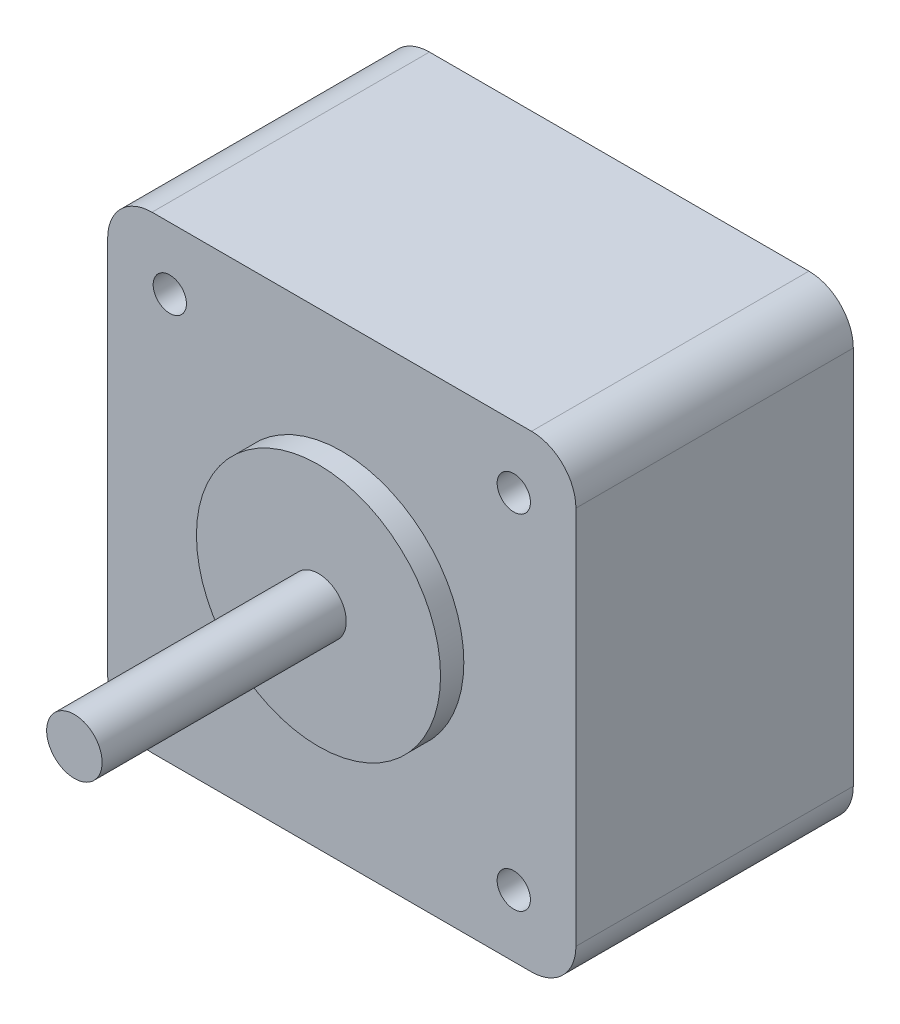
ISO-10303-21;
HEADER;
FILE_DESCRIPTION(('STEP AP214'),'2;1');
FILE_NAME('part.step','',(''),(''),'','','');
FILE_SCHEMA(('AUTOMOTIVE_DESIGN { 1 0 10303 214 1 1 1 1 }'));
ENDSEC;
DATA;
#1=APPLICATION_CONTEXT('core data for automotive mechanical design processes');
#2=APPLICATION_PROTOCOL_DEFINITION('international standard','automotive_design',2000,#1);
#3=PRODUCT_CONTEXT('',#1,'mechanical');
#4=PRODUCT('Part','Part','',(#3));
#5=PRODUCT_RELATED_PRODUCT_CATEGORY('part','',(#4));
#6=PRODUCT_DEFINITION_FORMATION('','',#4);
#7=PRODUCT_DEFINITION_CONTEXT('part definition',#1,'design');
#8=PRODUCT_DEFINITION('design','',#6,#7);
#9=PRODUCT_DEFINITION_SHAPE('','',#8);
#10=(LENGTH_UNIT() NAMED_UNIT(*) SI_UNIT(.MILLI.,.METRE.));
#11=(NAMED_UNIT(*) PLANE_ANGLE_UNIT() SI_UNIT($,.RADIAN.));
#12=(NAMED_UNIT(*) SI_UNIT($,.STERADIAN.) SOLID_ANGLE_UNIT());
#13=UNCERTAINTY_MEASURE_WITH_UNIT(LENGTH_MEASURE(1.E-05),#10,'distance_accuracy_value','');
#14=(GEOMETRIC_REPRESENTATION_CONTEXT(3) GLOBAL_UNCERTAINTY_ASSIGNED_CONTEXT((#13)) GLOBAL_UNIT_ASSIGNED_CONTEXT((#10,
#11,#12)) REPRESENTATION_CONTEXT('',''));
#15=CARTESIAN_POINT('',(0.,0.,0.));
#16=DIRECTION('',(0.,0.,1.));
#17=DIRECTION('',(1.,0.,0.));
#18=AXIS2_PLACEMENT_3D('',#15,#16,#17);
#19=CARTESIAN_POINT('',(21.1,-21.1,25.));
#20=DIRECTION('',(-1.,0.,0.));
#21=DIRECTION('',(0.,0.,1.));
#22=AXIS2_PLACEMENT_3D('',#19,#20,#21);
#23=PLANE('',#22);
#24=DIRECTION('',(0.,1.,0.));
#25=VECTOR('',#24,1.);
#26=CARTESIAN_POINT('',(21.1,-21.1,25.));
#27=LINE('',#26,#25);
#28=CARTESIAN_POINT('',(21.1,-17.1,25.));
#29=VERTEX_POINT('',#28);
#30=CARTESIAN_POINT('',(21.1,17.1,25.));
#31=VERTEX_POINT('',#30);
#32=EDGE_CURVE('E133',#29,#31,#27,.T.);
#33=ORIENTED_EDGE('',*,*,#32,.F.);
#34=DIRECTION('',(0.,0.,-1.));
#35=VECTOR('',#34,1.);
#36=CARTESIAN_POINT('',(21.1,-17.1,25.));
#37=LINE('',#36,#35);
#38=CARTESIAN_POINT('',(21.1,-17.1,0.));
#39=VERTEX_POINT('',#38);
#40=EDGE_CURVE('E117',#29,#39,#37,.T.);
#41=ORIENTED_EDGE('',*,*,#40,.T.);
#42=DIRECTION('',(0.,1.,0.));
#43=VECTOR('',#42,1.);
#44=CARTESIAN_POINT('',(21.1,-21.1,0.));
#45=LINE('',#44,#43);
#46=CARTESIAN_POINT('',(21.1,17.1,0.));
#47=VERTEX_POINT('',#46);
#48=EDGE_CURVE('E130',#39,#47,#45,.T.);
#49=ORIENTED_EDGE('',*,*,#48,.T.);
#50=DIRECTION('',(0.,0.,-1.));
#51=VECTOR('',#50,1.);
#52=CARTESIAN_POINT('',(21.1,17.1,25.));
#53=LINE('',#52,#51);
#54=EDGE_CURVE('E136',#47,#31,#53,.F.);
#55=ORIENTED_EDGE('',*,*,#54,.T.);
#56=EDGE_LOOP('',(#33,#41,#49,#55));
#57=FACE_BOUND('',#56,.T.);
#58=ADVANCED_FACE('F46',(#57),#23,.F.);
#59=CARTESIAN_POINT('',(-21.1,21.1,25.));
#60=DIRECTION('',(0.,-1.,0.));
#61=DIRECTION('',(0.,0.,-1.));
#62=AXIS2_PLACEMENT_3D('',#59,#60,#61);
#63=PLANE('',#62);
#64=DIRECTION('',(-1.,0.,0.));
#65=VECTOR('',#64,1.);
#66=CARTESIAN_POINT('',(-21.1,21.1,0.));
#67=LINE('',#66,#65);
#68=CARTESIAN_POINT('',(17.1,21.1,0.));
#69=VERTEX_POINT('',#68);
#70=CARTESIAN_POINT('',(-17.1,21.1,0.));
#71=VERTEX_POINT('',#70);
#72=EDGE_CURVE('E142',#69,#71,#67,.T.);
#73=ORIENTED_EDGE('',*,*,#72,.T.);
#74=DIRECTION('',(0.,0.,-1.));
#75=VECTOR('',#74,1.);
#76=CARTESIAN_POINT('',(-17.1,21.1,25.));
#77=LINE('',#76,#75);
#78=CARTESIAN_POINT('',(-17.1,21.1,25.));
#79=VERTEX_POINT('',#78);
#80=EDGE_CURVE('E11',#71,#79,#77,.F.);
#81=ORIENTED_EDGE('',*,*,#80,.T.);
#82=DIRECTION('',(-1.,0.,0.));
#83=VECTOR('',#82,1.);
#84=CARTESIAN_POINT('',(-21.1,21.1,25.));
#85=LINE('',#84,#83);
#86=CARTESIAN_POINT('',(17.1,21.1,25.));
#87=VERTEX_POINT('',#86);
#88=EDGE_CURVE('E204',#87,#79,#85,.T.);
#89=ORIENTED_EDGE('',*,*,#88,.F.);
#90=DIRECTION('',(0.,0.,-1.));
#91=VECTOR('',#90,1.);
#92=CARTESIAN_POINT('',(17.1,21.1,25.));
#93=LINE('',#92,#91);
#94=EDGE_CURVE('E55',#87,#69,#93,.T.);
#95=ORIENTED_EDGE('',*,*,#94,.T.);
#96=EDGE_LOOP('',(#73,#81,#89,#95));
#97=FACE_BOUND('',#96,.T.);
#98=ADVANCED_FACE('F202',(#97),#63,.F.);
#99=CARTESIAN_POINT('',(-21.1,-21.1,25.));
#100=DIRECTION('',(1.,0.,0.));
#101=DIRECTION('',(0.,0.,-1.));
#102=AXIS2_PLACEMENT_3D('',#99,#100,#101);
#103=PLANE('',#102);
#104=DIRECTION('',(0.,-1.,0.));
#105=VECTOR('',#104,1.);
#106=CARTESIAN_POINT('',(-21.1,-21.1,25.));
#107=LINE('',#106,#105);
#108=CARTESIAN_POINT('',(-21.1,17.1,25.));
#109=VERTEX_POINT('',#108);
#110=CARTESIAN_POINT('',(-21.1,-17.1,25.));
#111=VERTEX_POINT('',#110);
#112=EDGE_CURVE('E212',#109,#111,#107,.T.);
#113=ORIENTED_EDGE('',*,*,#112,.F.);
#114=DIRECTION('',(0.,0.,-1.));
#115=VECTOR('',#114,1.);
#116=CARTESIAN_POINT('',(-21.1,17.1,25.));
#117=LINE('',#116,#115);
#118=CARTESIAN_POINT('',(-21.1,17.1,0.));
#119=VERTEX_POINT('',#118);
#120=EDGE_CURVE('E192',#109,#119,#117,.T.);
#121=ORIENTED_EDGE('',*,*,#120,.T.);
#122=DIRECTION('',(0.,-1.,0.));
#123=VECTOR('',#122,1.);
#124=CARTESIAN_POINT('',(-21.1,-21.1,0.));
#125=LINE('',#124,#123);
#126=CARTESIAN_POINT('',(-21.1,-17.1,0.));
#127=VERTEX_POINT('',#126);
#128=EDGE_CURVE('E150',#119,#127,#125,.T.);
#129=ORIENTED_EDGE('',*,*,#128,.T.);
#130=DIRECTION('',(0.,0.,-1.));
#131=VECTOR('',#130,1.);
#132=CARTESIAN_POINT('',(-21.1,-17.1,25.));
#133=LINE('',#132,#131);
#134=EDGE_CURVE('E62',#127,#111,#133,.F.);
#135=ORIENTED_EDGE('',*,*,#134,.T.);
#136=EDGE_LOOP('',(#113,#121,#129,#135));
#137=FACE_BOUND('',#136,.T.);
#138=ADVANCED_FACE('F211',(#137),#103,.F.);
#139=CARTESIAN_POINT('',(-21.1,-21.1,25.));
#140=DIRECTION('',(0.,1.,0.));
#141=DIRECTION('',(0.,0.,1.));
#142=AXIS2_PLACEMENT_3D('',#139,#140,#141);
#143=PLANE('',#142);
#144=DIRECTION('',(1.,0.,0.));
#145=VECTOR('',#144,1.);
#146=CARTESIAN_POINT('',(-21.1,-21.1,0.));
#147=LINE('',#146,#145);
#148=CARTESIAN_POINT('',(-17.1,-21.1,0.));
#149=VERTEX_POINT('',#148);
#150=CARTESIAN_POINT('',(17.1,-21.1,0.));
#151=VERTEX_POINT('',#150);
#152=EDGE_CURVE('E162',#149,#151,#147,.T.);
#153=ORIENTED_EDGE('',*,*,#152,.T.);
#154=DIRECTION('',(0.,0.,-1.));
#155=VECTOR('',#154,1.);
#156=CARTESIAN_POINT('',(17.1,-21.1,25.));
#157=LINE('',#156,#155);
#158=CARTESIAN_POINT('',(17.1,-21.1,25.));
#159=VERTEX_POINT('',#158);
#160=EDGE_CURVE('E118',#151,#159,#157,.F.);
#161=ORIENTED_EDGE('',*,*,#160,.T.);
#162=DIRECTION('',(1.,0.,0.));
#163=VECTOR('',#162,1.);
#164=CARTESIAN_POINT('',(-21.1,-21.1,25.));
#165=LINE('',#164,#163);
#166=CARTESIAN_POINT('',(-17.1,-21.1,25.));
#167=VERTEX_POINT('',#166);
#168=EDGE_CURVE('E157',#167,#159,#165,.T.);
#169=ORIENTED_EDGE('',*,*,#168,.F.);
#170=DIRECTION('',(0.,0.,-1.));
#171=VECTOR('',#170,1.);
#172=CARTESIAN_POINT('',(-17.1,-21.1,25.));
#173=LINE('',#172,#171);
#174=EDGE_CURVE('E124',#167,#149,#173,.T.);
#175=ORIENTED_EDGE('',*,*,#174,.T.);
#176=EDGE_LOOP('',(#153,#161,#169,#175));
#177=FACE_BOUND('',#176,.T.);
#178=ADVANCED_FACE('F275',(#177),#143,.F.);
#179=CARTESIAN_POINT('',(0.,0.,25.));
#180=DIRECTION('',(0.,0.,-1.));
#181=DIRECTION('',(-1.,0.,0.));
#182=AXIS2_PLACEMENT_3D('',#179,#180,#181);
#183=PLANE('',#182);
#184=CARTESIAN_POINT('',(-15.5,-15.5,25.));
#185=DIRECTION('',(0.,0.,1.));
#186=DIRECTION('',(1.,0.,0.));
#187=AXIS2_PLACEMENT_3D('',#184,#185,#186);
#188=CIRCLE('',#187,1.5);
#189=CARTESIAN_POINT('',(-14.,-15.5,25.));
#190=VERTEX_POINT('',#189);
#191=EDGE_CURVE('E238',#190,#190,#188,.T.);
#192=ORIENTED_EDGE('',*,*,#191,.F.);
#193=EDGE_LOOP('',(#192));
#194=FACE_BOUND('',#193,.T.);
#195=CARTESIAN_POINT('',(15.5,-15.5,25.));
#196=DIRECTION('',(0.,0.,1.));
#197=DIRECTION('',(1.,0.,0.));
#198=AXIS2_PLACEMENT_3D('',#195,#196,#197);
#199=CIRCLE('',#198,1.5);
#200=CARTESIAN_POINT('',(17.,-15.5,25.));
#201=VERTEX_POINT('',#200);
#202=EDGE_CURVE('E246',#201,#201,#199,.T.);
#203=ORIENTED_EDGE('',*,*,#202,.F.);
#204=EDGE_LOOP('',(#203));
#205=FACE_BOUND('',#204,.T.);
#206=CARTESIAN_POINT('',(15.5,15.5,25.));
#207=DIRECTION('',(0.,0.,1.));
#208=DIRECTION('',(1.,0.,0.));
#209=AXIS2_PLACEMENT_3D('',#206,#207,#208);
#210=CIRCLE('',#209,1.5);
#211=CARTESIAN_POINT('',(17.,15.5,25.));
#212=VERTEX_POINT('',#211);
#213=EDGE_CURVE('E254',#212,#212,#210,.T.);
#214=ORIENTED_EDGE('',*,*,#213,.F.);
#215=EDGE_LOOP('',(#214));
#216=FACE_BOUND('',#215,.T.);
#217=CARTESIAN_POINT('',(-15.5,15.5,25.));
#218=DIRECTION('',(0.,0.,1.));
#219=DIRECTION('',(1.,0.,0.));
#220=AXIS2_PLACEMENT_3D('',#217,#218,#219);
#221=CIRCLE('',#220,1.5);
#222=CARTESIAN_POINT('',(-14.,15.5,25.));
#223=VERTEX_POINT('',#222);
#224=EDGE_CURVE('E231',#223,#223,#221,.T.);
#225=ORIENTED_EDGE('',*,*,#224,.F.);
#226=EDGE_LOOP('',(#225));
#227=FACE_BOUND('',#226,.T.);
#228=CARTESIAN_POINT('',(0.,0.,25.));
#229=DIRECTION('',(0.,0.,1.));
#230=DIRECTION('',(1.,0.,0.));
#231=AXIS2_PLACEMENT_3D('',#228,#229,#230);
#232=CIRCLE('',#231,11.);
#233=CARTESIAN_POINT('',(11.,0.,25.));
#234=VERTEX_POINT('',#233);
#235=EDGE_CURVE('E219',#234,#234,#232,.T.);
#236=ORIENTED_EDGE('',*,*,#235,.F.);
#237=EDGE_LOOP('',(#236));
#238=FACE_BOUND('',#237,.T.);
#239=ORIENTED_EDGE('',*,*,#168,.T.);
#240=CARTESIAN_POINT('',(17.1,-17.1,25.));
#241=DIRECTION('',(0.,0.,-1.));
#242=DIRECTION('',(-1.,0.,0.));
#243=AXIS2_PLACEMENT_3D('',#240,#241,#242);
#244=CIRCLE('',#243,4.);
#245=EDGE_CURVE('E187',#159,#29,#244,.F.);
#246=ORIENTED_EDGE('',*,*,#245,.T.);
#247=ORIENTED_EDGE('',*,*,#32,.T.);
#248=CARTESIAN_POINT('',(17.1,17.1,25.));
#249=DIRECTION('',(0.,0.,-1.));
#250=DIRECTION('',(-1.,0.,0.));
#251=AXIS2_PLACEMENT_3D('',#248,#249,#250);
#252=CIRCLE('',#251,4.);
#253=EDGE_CURVE('E182',#31,#87,#252,.F.);
#254=ORIENTED_EDGE('',*,*,#253,.T.);
#255=ORIENTED_EDGE('',*,*,#88,.T.);
#256=CARTESIAN_POINT('',(-17.1,17.1,25.));
#257=DIRECTION('',(0.,0.,-1.));
#258=DIRECTION('',(-1.,0.,0.));
#259=AXIS2_PLACEMENT_3D('',#256,#257,#258);
#260=CIRCLE('',#259,4.);
#261=EDGE_CURVE('E69',#79,#109,#260,.F.);
#262=ORIENTED_EDGE('',*,*,#261,.T.);
#263=ORIENTED_EDGE('',*,*,#112,.T.);
#264=CARTESIAN_POINT('',(-17.1,-17.1,25.));
#265=DIRECTION('',(0.,0.,-1.));
#266=DIRECTION('',(-1.,0.,0.));
#267=AXIS2_PLACEMENT_3D('',#264,#265,#266);
#268=CIRCLE('',#267,4.);
#269=EDGE_CURVE('E179',#111,#167,#268,.F.);
#270=ORIENTED_EDGE('',*,*,#269,.T.);
#271=EDGE_LOOP('',(#239,#246,#247,#254,#255,#262,#263,#270));
#272=FACE_BOUND('',#271,.T.);
#273=ADVANCED_FACE('F272',(#194,#205,#216,#227,#238,#272),#183,.F.);
#274=CARTESIAN_POINT('',(0.,0.,0.));
#275=DIRECTION('',(0.,0.,-1.));
#276=DIRECTION('',(-1.,0.,0.));
#277=AXIS2_PLACEMENT_3D('',#274,#275,#276);
#278=PLANE('',#277);
#279=ORIENTED_EDGE('',*,*,#48,.F.);
#280=CARTESIAN_POINT('',(17.1,-17.1,0.));
#281=DIRECTION('',(0.,0.,-1.));
#282=DIRECTION('',(-1.,0.,0.));
#283=AXIS2_PLACEMENT_3D('',#280,#281,#282);
#284=CIRCLE('',#283,4.);
#285=EDGE_CURVE('E113',#39,#151,#284,.T.);
#286=ORIENTED_EDGE('',*,*,#285,.T.);
#287=ORIENTED_EDGE('',*,*,#152,.F.);
#288=CARTESIAN_POINT('',(-17.1,-17.1,0.));
#289=DIRECTION('',(0.,0.,-1.));
#290=DIRECTION('',(-1.,0.,0.));
#291=AXIS2_PLACEMENT_3D('',#288,#289,#290);
#292=CIRCLE('',#291,4.);
#293=EDGE_CURVE('E135',#149,#127,#292,.T.);
#294=ORIENTED_EDGE('',*,*,#293,.T.);
#295=ORIENTED_EDGE('',*,*,#128,.F.);
#296=CARTESIAN_POINT('',(-17.1,17.1,0.));
#297=DIRECTION('',(0.,0.,-1.));
#298=DIRECTION('',(-1.,0.,0.));
#299=AXIS2_PLACEMENT_3D('',#296,#297,#298);
#300=CIRCLE('',#299,4.);
#301=EDGE_CURVE('E125',#119,#71,#300,.T.);
#302=ORIENTED_EDGE('',*,*,#301,.T.);
#303=ORIENTED_EDGE('',*,*,#72,.F.);
#304=CARTESIAN_POINT('',(17.1,17.1,0.));
#305=DIRECTION('',(0.,0.,-1.));
#306=DIRECTION('',(-1.,0.,0.));
#307=AXIS2_PLACEMENT_3D('',#304,#305,#306);
#308=CIRCLE('',#307,4.);
#309=EDGE_CURVE('E140',#69,#47,#308,.T.);
#310=ORIENTED_EDGE('',*,*,#309,.T.);
#311=EDGE_LOOP('',(#279,#286,#287,#294,#295,#302,#303,#310));
#312=FACE_BOUND('',#311,.T.);
#313=ADVANCED_FACE('F138',(#312),#278,.T.);
#314=CARTESIAN_POINT('',(0.,0.,27.1));
#315=DIRECTION('',(0.,0.,-1.));
#316=DIRECTION('',(-1.,0.,0.));
#317=AXIS2_PLACEMENT_3D('',#314,#315,#316);
#318=CYLINDRICAL_SURFACE('',#317,11.);
#319=CARTESIAN_POINT('',(0.,0.,27.1));
#320=DIRECTION('',(0.,0.,1.));
#321=DIRECTION('',(1.,0.,0.));
#322=AXIS2_PLACEMENT_3D('',#319,#320,#321);
#323=CIRCLE('',#322,11.);
#324=CARTESIAN_POINT('',(11.,0.,27.1));
#325=VERTEX_POINT('',#324);
#326=EDGE_CURVE('E143',#325,#325,#323,.T.);
#327=ORIENTED_EDGE('',*,*,#326,.F.);
#328=EDGE_LOOP('',(#327));
#329=FACE_BOUND('',#328,.T.);
#330=ORIENTED_EDGE('',*,*,#235,.T.);
#331=EDGE_LOOP('',(#330));
#332=FACE_BOUND('',#331,.T.);
#333=ADVANCED_FACE('F445',(#329,#332),#318,.T.);
#334=CARTESIAN_POINT('',(0.,0.,27.1));
#335=DIRECTION('',(0.,0.,1.));
#336=DIRECTION('',(1.,0.,0.));
#337=AXIS2_PLACEMENT_3D('',#334,#335,#336);
#338=PLANE('',#337);
#339=CARTESIAN_POINT('',(0.,0.,27.1));
#340=DIRECTION('',(0.,0.,1.));
#341=DIRECTION('',(1.,0.,0.));
#342=AXIS2_PLACEMENT_3D('',#339,#340,#341);
#343=CIRCLE('',#342,2.5);
#344=CARTESIAN_POINT('',(2.5,0.,27.1));
#345=VERTEX_POINT('',#344);
#346=EDGE_CURVE('E166',#345,#345,#343,.T.);
#347=ORIENTED_EDGE('',*,*,#346,.F.);
#348=EDGE_LOOP('',(#347));
#349=FACE_BOUND('',#348,.T.);
#350=ORIENTED_EDGE('',*,*,#326,.T.);
#351=EDGE_LOOP('',(#350));
#352=FACE_BOUND('',#351,.T.);
#353=ADVANCED_FACE('F497',(#349,#352),#338,.T.);
#354=CARTESIAN_POINT('',(0.,0.,49.1));
#355=DIRECTION('',(0.,0.,-1.));
#356=DIRECTION('',(-1.,0.,0.));
#357=AXIS2_PLACEMENT_3D('',#354,#355,#356);
#358=CYLINDRICAL_SURFACE('',#357,2.5);
#359=CARTESIAN_POINT('',(0.,0.,49.1));
#360=DIRECTION('',(0.,0.,1.));
#361=DIRECTION('',(1.,0.,0.));
#362=AXIS2_PLACEMENT_3D('',#359,#360,#361);
#363=CIRCLE('',#362,2.5);
#364=CARTESIAN_POINT('',(2.5,0.,49.1));
#365=VERTEX_POINT('',#364);
#366=EDGE_CURVE('E154',#365,#365,#363,.T.);
#367=ORIENTED_EDGE('',*,*,#366,.F.);
#368=EDGE_LOOP('',(#367));
#369=FACE_BOUND('',#368,.T.);
#370=ORIENTED_EDGE('',*,*,#346,.T.);
#371=EDGE_LOOP('',(#370));
#372=FACE_BOUND('',#371,.T.);
#373=ADVANCED_FACE('F328',(#369,#372),#358,.T.);
#374=CARTESIAN_POINT('',(0.,0.,49.1));
#375=DIRECTION('',(0.,0.,1.));
#376=DIRECTION('',(1.,0.,0.));
#377=AXIS2_PLACEMENT_3D('',#374,#375,#376);
#378=PLANE('',#377);
#379=ORIENTED_EDGE('',*,*,#366,.T.);
#380=EDGE_LOOP('',(#379));
#381=FACE_BOUND('',#380,.T.);
#382=ADVANCED_FACE('F321',(#381),#378,.T.);
#383=CARTESIAN_POINT('',(-15.5,15.5,21.));
#384=DIRECTION('',(0.,0.,1.));
#385=DIRECTION('',(1.,0.,0.));
#386=AXIS2_PLACEMENT_3D('',#383,#384,#385);
#387=CYLINDRICAL_SURFACE('',#386,1.5);
#388=CARTESIAN_POINT('',(-15.5,15.5,21.));
#389=DIRECTION('',(0.,0.,1.));
#390=DIRECTION('',(1.,0.,0.));
#391=AXIS2_PLACEMENT_3D('',#388,#389,#390);
#392=CIRCLE('',#391,1.5);
#393=CARTESIAN_POINT('',(-14.,15.5,21.));
#394=VERTEX_POINT('',#393);
#395=EDGE_CURVE('E230',#394,#394,#392,.T.);
#396=ORIENTED_EDGE('',*,*,#395,.F.);
#397=EDGE_LOOP('',(#396));
#398=FACE_BOUND('',#397,.T.);
#399=ORIENTED_EDGE('',*,*,#224,.T.);
#400=EDGE_LOOP('',(#399));
#401=FACE_BOUND('',#400,.T.);
#402=ADVANCED_FACE('F327',(#398,#401),#387,.F.);
#403=CARTESIAN_POINT('',(-15.5,15.5,21.));
#404=DIRECTION('',(0.,0.,1.));
#405=DIRECTION('',(1.,0.,0.));
#406=AXIS2_PLACEMENT_3D('',#403,#404,#405);
#407=PLANE('',#406);
#408=ORIENTED_EDGE('',*,*,#395,.T.);
#409=EDGE_LOOP('',(#408));
#410=FACE_BOUND('',#409,.T.);
#411=ADVANCED_FACE('F268',(#410),#407,.T.);
#412=CARTESIAN_POINT('',(15.5,15.5,21.));
#413=DIRECTION('',(0.,0.,1.));
#414=DIRECTION('',(1.,0.,0.));
#415=AXIS2_PLACEMENT_3D('',#412,#413,#414);
#416=CYLINDRICAL_SURFACE('',#415,1.5);
#417=CARTESIAN_POINT('',(15.5,15.5,21.));
#418=DIRECTION('',(0.,0.,1.));
#419=DIRECTION('',(1.,0.,0.));
#420=AXIS2_PLACEMENT_3D('',#417,#418,#419);
#421=CIRCLE('',#420,1.5);
#422=CARTESIAN_POINT('',(17.,15.5,21.));
#423=VERTEX_POINT('',#422);
#424=EDGE_CURVE('E234',#423,#423,#421,.T.);
#425=ORIENTED_EDGE('',*,*,#424,.F.);
#426=EDGE_LOOP('',(#425));
#427=FACE_BOUND('',#426,.T.);
#428=ORIENTED_EDGE('',*,*,#213,.T.);
#429=EDGE_LOOP('',(#428));
#430=FACE_BOUND('',#429,.T.);
#431=ADVANCED_FACE('F265',(#427,#430),#416,.F.);
#432=CARTESIAN_POINT('',(15.5,15.5,21.));
#433=DIRECTION('',(0.,0.,1.));
#434=DIRECTION('',(1.,0.,0.));
#435=AXIS2_PLACEMENT_3D('',#432,#433,#434);
#436=PLANE('',#435);
#437=ORIENTED_EDGE('',*,*,#424,.T.);
#438=EDGE_LOOP('',(#437));
#439=FACE_BOUND('',#438,.T.);
#440=ADVANCED_FACE('F263',(#439),#436,.T.);
#441=CARTESIAN_POINT('',(15.5,-15.5,21.));
#442=DIRECTION('',(0.,0.,1.));
#443=DIRECTION('',(1.,0.,0.));
#444=AXIS2_PLACEMENT_3D('',#441,#442,#443);
#445=CYLINDRICAL_SURFACE('',#444,1.5);
#446=CARTESIAN_POINT('',(15.5,-15.5,21.));
#447=DIRECTION('',(0.,0.,1.));
#448=DIRECTION('',(1.,0.,0.));
#449=AXIS2_PLACEMENT_3D('',#446,#447,#448);
#450=CIRCLE('',#449,1.5);
#451=CARTESIAN_POINT('',(17.,-15.5,21.));
#452=VERTEX_POINT('',#451);
#453=EDGE_CURVE('E250',#452,#452,#450,.T.);
#454=ORIENTED_EDGE('',*,*,#453,.F.);
#455=EDGE_LOOP('',(#454));
#456=FACE_BOUND('',#455,.T.);
#457=ORIENTED_EDGE('',*,*,#202,.T.);
#458=EDGE_LOOP('',(#457));
#459=FACE_BOUND('',#458,.T.);
#460=ADVANCED_FACE('F348',(#456,#459),#445,.F.);
#461=CARTESIAN_POINT('',(15.5,-15.5,21.));
#462=DIRECTION('',(0.,0.,1.));
#463=DIRECTION('',(1.,0.,0.));
#464=AXIS2_PLACEMENT_3D('',#461,#462,#463);
#465=PLANE('',#464);
#466=ORIENTED_EDGE('',*,*,#453,.T.);
#467=EDGE_LOOP('',(#466));
#468=FACE_BOUND('',#467,.T.);
#469=ADVANCED_FACE('F341',(#468),#465,.T.);
#470=CARTESIAN_POINT('',(-15.5,-15.5,21.));
#471=DIRECTION('',(0.,0.,1.));
#472=DIRECTION('',(1.,0.,0.));
#473=AXIS2_PLACEMENT_3D('',#470,#471,#472);
#474=CYLINDRICAL_SURFACE('',#473,1.5);
#475=CARTESIAN_POINT('',(-15.5,-15.5,21.));
#476=DIRECTION('',(0.,0.,1.));
#477=DIRECTION('',(1.,0.,0.));
#478=AXIS2_PLACEMENT_3D('',#475,#476,#477);
#479=CIRCLE('',#478,1.5);
#480=CARTESIAN_POINT('',(-14.,-15.5,21.));
#481=VERTEX_POINT('',#480);
#482=EDGE_CURVE('E242',#481,#481,#479,.T.);
#483=ORIENTED_EDGE('',*,*,#482,.F.);
#484=EDGE_LOOP('',(#483));
#485=FACE_BOUND('',#484,.T.);
#486=ORIENTED_EDGE('',*,*,#191,.T.);
#487=EDGE_LOOP('',(#486));
#488=FACE_BOUND('',#487,.T.);
#489=ADVANCED_FACE('F337',(#485,#488),#474,.F.);
#490=CARTESIAN_POINT('',(-15.5,-15.5,21.));
#491=DIRECTION('',(0.,0.,1.));
#492=DIRECTION('',(1.,0.,0.));
#493=AXIS2_PLACEMENT_3D('',#490,#491,#492);
#494=PLANE('',#493);
#495=ORIENTED_EDGE('',*,*,#482,.T.);
#496=EDGE_LOOP('',(#495));
#497=FACE_BOUND('',#496,.T.);
#498=ADVANCED_FACE('F303',(#497),#494,.T.);
#499=CARTESIAN_POINT('',(17.1,-17.1,25.));
#500=DIRECTION('',(0.,0.,-1.));
#501=DIRECTION('',(-1.,0.,0.));
#502=AXIS2_PLACEMENT_3D('',#499,#500,#501);
#503=CYLINDRICAL_SURFACE('',#502,4.);
#504=ORIENTED_EDGE('',*,*,#245,.F.);
#505=ORIENTED_EDGE('',*,*,#160,.F.);
#506=ORIENTED_EDGE('',*,*,#285,.F.);
#507=ORIENTED_EDGE('',*,*,#40,.F.);
#508=EDGE_LOOP('',(#504,#505,#506,#507));
#509=FACE_BOUND('',#508,.T.);
#510=ADVANCED_FACE('F116',(#509),#503,.T.);
#511=CARTESIAN_POINT('',(-17.1,17.1,25.));
#512=DIRECTION('',(0.,0.,-1.));
#513=DIRECTION('',(-1.,0.,0.));
#514=AXIS2_PLACEMENT_3D('',#511,#512,#513);
#515=CYLINDRICAL_SURFACE('',#514,4.);
#516=ORIENTED_EDGE('',*,*,#261,.F.);
#517=ORIENTED_EDGE('',*,*,#80,.F.);
#518=ORIENTED_EDGE('',*,*,#301,.F.);
#519=ORIENTED_EDGE('',*,*,#120,.F.);
#520=EDGE_LOOP('',(#516,#517,#518,#519));
#521=FACE_BOUND('',#520,.T.);
#522=ADVANCED_FACE('F210',(#521),#515,.T.);
#523=CARTESIAN_POINT('',(17.1,17.1,25.));
#524=DIRECTION('',(0.,0.,-1.));
#525=DIRECTION('',(-1.,0.,0.));
#526=AXIS2_PLACEMENT_3D('',#523,#524,#525);
#527=CYLINDRICAL_SURFACE('',#526,4.);
#528=ORIENTED_EDGE('',*,*,#253,.F.);
#529=ORIENTED_EDGE('',*,*,#54,.F.);
#530=ORIENTED_EDGE('',*,*,#309,.F.);
#531=ORIENTED_EDGE('',*,*,#94,.F.);
#532=EDGE_LOOP('',(#528,#529,#530,#531));
#533=FACE_BOUND('',#532,.T.);
#534=ADVANCED_FACE('F286',(#533),#527,.T.);
#535=CARTESIAN_POINT('',(-17.1,-17.1,25.));
#536=DIRECTION('',(0.,0.,-1.));
#537=DIRECTION('',(-1.,0.,0.));
#538=AXIS2_PLACEMENT_3D('',#535,#536,#537);
#539=CYLINDRICAL_SURFACE('',#538,4.);
#540=ORIENTED_EDGE('',*,*,#269,.F.);
#541=ORIENTED_EDGE('',*,*,#134,.F.);
#542=ORIENTED_EDGE('',*,*,#293,.F.);
#543=ORIENTED_EDGE('',*,*,#174,.F.);
#544=EDGE_LOOP('',(#540,#541,#542,#543));
#545=FACE_BOUND('',#544,.T.);
#546=ADVANCED_FACE('F48',(#545),#539,.T.);
#547=CLOSED_SHELL('',(#58,#98,#138,#178,#273,#313,#333,#353,#373,#382,#402,#411,#431,#440,#460,
#469,#489,#498,#510,#522,#534,#546));
#548=MANIFOLD_SOLID_BREP('B2',#547);
#549=ADVANCED_BREP_SHAPE_REPRESENTATION('',(#18,#548),#14);
#550=SHAPE_DEFINITION_REPRESENTATION(#9,#549);
ENDSEC;
END-ISO-10303-21;
